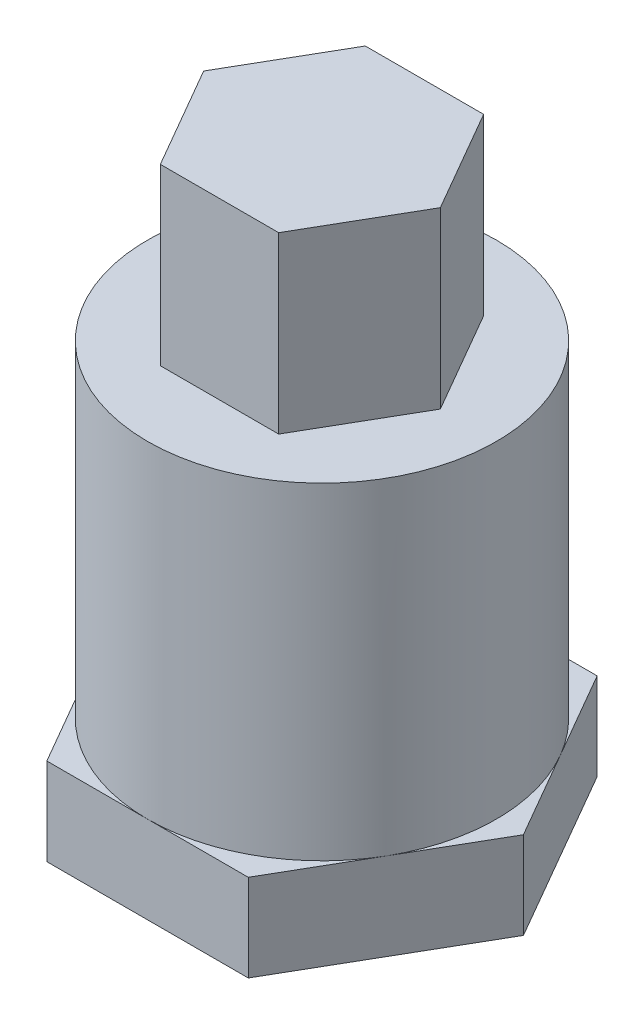
ISO-10303-21;
HEADER;
FILE_DESCRIPTION(('STEP AP214'),'2;1');
FILE_NAME('part.step','',(''),(''),'','','');
FILE_SCHEMA(('AUTOMOTIVE_DESIGN { 1 0 10303 214 1 1 1 1 }'));
ENDSEC;
DATA;
#1=APPLICATION_CONTEXT('core data for automotive mechanical design processes');
#2=APPLICATION_PROTOCOL_DEFINITION('international standard','automotive_design',2000,#1);
#3=PRODUCT_CONTEXT('',#1,'mechanical');
#4=PRODUCT('Part','Part','',(#3));
#5=PRODUCT_RELATED_PRODUCT_CATEGORY('part','',(#4));
#6=PRODUCT_DEFINITION_FORMATION('','',#4);
#7=PRODUCT_DEFINITION_CONTEXT('part definition',#1,'design');
#8=PRODUCT_DEFINITION('design','',#6,#7);
#9=PRODUCT_DEFINITION_SHAPE('','',#8);
#10=(LENGTH_UNIT() NAMED_UNIT(*) SI_UNIT(.MILLI.,.METRE.));
#11=(NAMED_UNIT(*) PLANE_ANGLE_UNIT() SI_UNIT($,.RADIAN.));
#12=(NAMED_UNIT(*) SI_UNIT($,.STERADIAN.) SOLID_ANGLE_UNIT());
#13=UNCERTAINTY_MEASURE_WITH_UNIT(LENGTH_MEASURE(1.E-05),#10,'distance_accuracy_value','');
#14=(GEOMETRIC_REPRESENTATION_CONTEXT(3) GLOBAL_UNCERTAINTY_ASSIGNED_CONTEXT((#13)) GLOBAL_UNIT_ASSIGNED_CONTEXT((#10,
#11,#12)) REPRESENTATION_CONTEXT('',''));
#15=CARTESIAN_POINT('',(0.,0.,0.));
#16=DIRECTION('',(0.,0.,1.));
#17=DIRECTION('',(1.,0.,0.));
#18=AXIS2_PLACEMENT_3D('',#15,#16,#17);
#19=CARTESIAN_POINT('',(2.71354626519129,8.,4.69999999999995));
#20=DIRECTION('',(-0.866025403784441,0.,-0.499999999999995));
#21=DIRECTION('',(-0.499999999999995,0.,0.866025403784442));
#22=AXIS2_PLACEMENT_3D('',#19,#20,#21);
#23=PLANE('',#22);
#24=DIRECTION('',(0.499999999999995,0.,-0.866025403784441));
#25=VECTOR('',#24,1.);
#26=CARTESIAN_POINT('',(2.71354626519129,0.,4.69999999999995));
#27=LINE('',#26,#25);
#28=CARTESIAN_POINT('',(2.71354626519129,0.,4.69999999999995));
#29=VERTEX_POINT('',#28);
#30=CARTESIAN_POINT('',(5.42709253038246,0.,0.));
#31=VERTEX_POINT('',#30);
#32=EDGE_CURVE('E86',#29,#31,#27,.T.);
#33=ORIENTED_EDGE('',*,*,#32,.T.);
#34=DIRECTION('',(0.,-1.,0.));
#35=VECTOR('',#34,1.);
#36=CARTESIAN_POINT('',(5.42709253038246,8.,0.));
#37=LINE('',#36,#35);
#38=CARTESIAN_POINT('',(5.42709253038246,8.,0.));
#39=VERTEX_POINT('',#38);
#40=EDGE_CURVE('E11',#39,#31,#37,.T.);
#41=ORIENTED_EDGE('',*,*,#40,.F.);
#42=DIRECTION('',(0.499999999999995,0.,-0.866025403784441));
#43=VECTOR('',#42,1.);
#44=CARTESIAN_POINT('',(2.71354626519129,8.,4.69999999999995));
#45=LINE('',#44,#43);
#46=CARTESIAN_POINT('',(2.71354626519129,8.,4.69999999999995));
#47=VERTEX_POINT('',#46);
#48=EDGE_CURVE('E147',#47,#39,#45,.T.);
#49=ORIENTED_EDGE('',*,*,#48,.F.);
#50=DIRECTION('',(0.,-1.,0.));
#51=VECTOR('',#50,1.);
#52=CARTESIAN_POINT('',(2.71354626519129,8.,4.69999999999995));
#53=LINE('',#52,#51);
#54=EDGE_CURVE('E127',#47,#29,#53,.T.);
#55=ORIENTED_EDGE('',*,*,#54,.T.);
#56=EDGE_LOOP('',(#33,#41,#49,#55));
#57=FACE_BOUND('',#56,.T.);
#58=ADVANCED_FACE('F39',(#57),#23,.F.);
#59=CARTESIAN_POINT('',(5.42709253038246,8.,0.));
#60=DIRECTION('',(-0.866025403784438,0.,0.500000000000001));
#61=DIRECTION('',(0.500000000000001,0.,0.866025403784438));
#62=AXIS2_PLACEMENT_3D('',#59,#60,#61);
#63=PLANE('',#62);
#64=DIRECTION('',(-0.500000000000001,0.,-0.866025403784438));
#65=VECTOR('',#64,1.);
#66=CARTESIAN_POINT('',(5.42709253038246,0.,0.));
#67=LINE('',#66,#65);
#68=CARTESIAN_POINT('',(2.71354626519122,0.,-4.69999999999999));
#69=VERTEX_POINT('',#68);
#70=EDGE_CURVE('E133',#31,#69,#67,.T.);
#71=ORIENTED_EDGE('',*,*,#70,.T.);
#72=DIRECTION('',(0.,-1.,0.));
#73=VECTOR('',#72,1.);
#74=CARTESIAN_POINT('',(2.71354626519122,8.,-4.69999999999999));
#75=LINE('',#74,#73);
#76=CARTESIAN_POINT('',(2.71354626519122,8.,-4.69999999999999));
#77=VERTEX_POINT('',#76);
#78=EDGE_CURVE('E47',#77,#69,#75,.T.);
#79=ORIENTED_EDGE('',*,*,#78,.F.);
#80=DIRECTION('',(-0.500000000000001,0.,-0.866025403784438));
#81=VECTOR('',#80,1.);
#82=CARTESIAN_POINT('',(5.42709253038246,8.,0.));
#83=LINE('',#82,#81);
#84=EDGE_CURVE('E162',#39,#77,#83,.T.);
#85=ORIENTED_EDGE('',*,*,#84,.F.);
#86=ORIENTED_EDGE('',*,*,#40,.T.);
#87=EDGE_LOOP('',(#71,#79,#85,#86));
#88=FACE_BOUND('',#87,.T.);
#89=ADVANCED_FACE('F161',(#88),#63,.F.);
#90=CARTESIAN_POINT('',(2.71354626519122,8.,-4.69999999999999));
#91=DIRECTION('',(0.,0.,1.));
#92=DIRECTION('',(1.,0.,0.));
#93=AXIS2_PLACEMENT_3D('',#90,#91,#92);
#94=PLANE('',#93);
#95=DIRECTION('',(-1.,0.,0.));
#96=VECTOR('',#95,1.);
#97=CARTESIAN_POINT('',(2.71354626519122,0.,-4.69999999999999));
#98=LINE('',#97,#96);
#99=CARTESIAN_POINT('',(-2.71354626519125,0.,-4.69999999999997));
#100=VERTEX_POINT('',#99);
#101=EDGE_CURVE('E76',#69,#100,#98,.T.);
#102=ORIENTED_EDGE('',*,*,#101,.T.);
#103=DIRECTION('',(0.,-1.,0.));
#104=VECTOR('',#103,1.);
#105=CARTESIAN_POINT('',(-2.71354626519125,8.,-4.69999999999997));
#106=LINE('',#105,#104);
#107=CARTESIAN_POINT('',(-2.71354626519125,8.,-4.69999999999997));
#108=VERTEX_POINT('',#107);
#109=EDGE_CURVE('E119',#108,#100,#106,.T.);
#110=ORIENTED_EDGE('',*,*,#109,.F.);
#111=DIRECTION('',(-1.,0.,0.));
#112=VECTOR('',#111,1.);
#113=CARTESIAN_POINT('',(2.71354626519122,8.,-4.69999999999999));
#114=LINE('',#113,#112);
#115=EDGE_CURVE('E105',#77,#108,#114,.T.);
#116=ORIENTED_EDGE('',*,*,#115,.F.);
#117=ORIENTED_EDGE('',*,*,#78,.T.);
#118=EDGE_LOOP('',(#102,#110,#116,#117));
#119=FACE_BOUND('',#118,.T.);
#120=ADVANCED_FACE('F158',(#119),#94,.F.);
#121=CARTESIAN_POINT('',(-2.71354626519125,8.,-4.69999999999997));
#122=DIRECTION('',(0.866025403784442,0.,0.499999999999995));
#123=DIRECTION('',(0.499999999999995,0.,-0.866025403784442));
#124=AXIS2_PLACEMENT_3D('',#121,#122,#123);
#125=PLANE('',#124);
#126=DIRECTION('',(-0.499999999999995,0.,0.866025403784442));
#127=VECTOR('',#126,1.);
#128=CARTESIAN_POINT('',(-2.71354626519125,0.,-4.69999999999997));
#129=LINE('',#128,#127);
#130=CARTESIAN_POINT('',(-5.42709253038246,0.,0.));
#131=VERTEX_POINT('',#130);
#132=EDGE_CURVE('E115',#100,#131,#129,.T.);
#133=ORIENTED_EDGE('',*,*,#132,.T.);
#134=DIRECTION('',(0.,-1.,0.));
#135=VECTOR('',#134,1.);
#136=CARTESIAN_POINT('',(-5.42709253038246,8.,0.));
#137=LINE('',#136,#135);
#138=CARTESIAN_POINT('',(-5.42709253038246,8.,0.));
#139=VERTEX_POINT('',#138);
#140=EDGE_CURVE('E113',#139,#131,#137,.T.);
#141=ORIENTED_EDGE('',*,*,#140,.F.);
#142=DIRECTION('',(-0.499999999999995,0.,0.866025403784442));
#143=VECTOR('',#142,1.);
#144=CARTESIAN_POINT('',(-2.71354626519125,8.,-4.69999999999997));
#145=LINE('',#144,#143);
#146=EDGE_CURVE('E98',#108,#139,#145,.T.);
#147=ORIENTED_EDGE('',*,*,#146,.F.);
#148=ORIENTED_EDGE('',*,*,#109,.T.);
#149=EDGE_LOOP('',(#133,#141,#147,#148));
#150=FACE_BOUND('',#149,.T.);
#151=ADVANCED_FACE('F114',(#150),#125,.F.);
#152=CARTESIAN_POINT('',(-5.42709253038246,8.,0.));
#153=DIRECTION('',(0.866025403784435,0.,-0.500000000000007));
#154=DIRECTION('',(-0.500000000000007,0.,-0.866025403784434));
#155=AXIS2_PLACEMENT_3D('',#152,#153,#154);
#156=PLANE('',#155);
#157=DIRECTION('',(0.500000000000007,0.,0.866025403784434));
#158=VECTOR('',#157,1.);
#159=CARTESIAN_POINT('',(-5.42709253038246,0.,0.));
#160=LINE('',#159,#158);
#161=CARTESIAN_POINT('',(-2.71354626519119,0.,4.70000000000001));
#162=VERTEX_POINT('',#161);
#163=EDGE_CURVE('E141',#131,#162,#160,.T.);
#164=ORIENTED_EDGE('',*,*,#163,.T.);
#165=DIRECTION('',(0.,-1.,0.));
#166=VECTOR('',#165,1.);
#167=CARTESIAN_POINT('',(-2.71354626519119,8.,4.70000000000001));
#168=LINE('',#167,#166);
#169=CARTESIAN_POINT('',(-2.71354626519119,8.,4.70000000000001));
#170=VERTEX_POINT('',#169);
#171=EDGE_CURVE('E120',#170,#162,#168,.T.);
#172=ORIENTED_EDGE('',*,*,#171,.F.);
#173=DIRECTION('',(0.500000000000007,0.,0.866025403784434));
#174=VECTOR('',#173,1.);
#175=CARTESIAN_POINT('',(-5.42709253038246,8.,0.));
#176=LINE('',#175,#174);
#177=EDGE_CURVE('E102',#139,#170,#176,.T.);
#178=ORIENTED_EDGE('',*,*,#177,.F.);
#179=ORIENTED_EDGE('',*,*,#140,.T.);
#180=EDGE_LOOP('',(#164,#172,#178,#179));
#181=FACE_BOUND('',#180,.T.);
#182=ADVANCED_FACE('F122',(#181),#156,.F.);
#183=CARTESIAN_POINT('',(-2.71354626519119,8.,4.70000000000001));
#184=DIRECTION('',(0.,0.,-1.));
#185=DIRECTION('',(-1.,0.,0.));
#186=AXIS2_PLACEMENT_3D('',#183,#184,#185);
#187=PLANE('',#186);
#188=DIRECTION('',(1.,0.,0.));
#189=VECTOR('',#188,1.);
#190=CARTESIAN_POINT('',(-2.71354626519119,0.,4.70000000000001));
#191=LINE('',#190,#189);
#192=EDGE_CURVE('E144',#162,#29,#191,.T.);
#193=ORIENTED_EDGE('',*,*,#192,.T.);
#194=ORIENTED_EDGE('',*,*,#54,.F.);
#195=DIRECTION('',(1.,0.,0.));
#196=VECTOR('',#195,1.);
#197=CARTESIAN_POINT('',(-2.71354626519119,8.,4.70000000000001));
#198=LINE('',#197,#196);
#199=EDGE_CURVE('E63',#170,#47,#198,.T.);
#200=ORIENTED_EDGE('',*,*,#199,.F.);
#201=ORIENTED_EDGE('',*,*,#171,.T.);
#202=EDGE_LOOP('',(#193,#194,#200,#201));
#203=FACE_BOUND('',#202,.T.);
#204=ADVANCED_FACE('F176',(#203),#187,.F.);
#205=CARTESIAN_POINT('',(0.,8.,0.));
#206=DIRECTION('',(0.,1.,0.));
#207=DIRECTION('',(0.,0.,1.));
#208=AXIS2_PLACEMENT_3D('',#205,#206,#207);
#209=PLANE('',#208);
#210=ORIENTED_EDGE('',*,*,#48,.T.);
#211=ORIENTED_EDGE('',*,*,#84,.T.);
#212=ORIENTED_EDGE('',*,*,#115,.T.);
#213=ORIENTED_EDGE('',*,*,#146,.T.);
#214=ORIENTED_EDGE('',*,*,#177,.T.);
#215=ORIENTED_EDGE('',*,*,#199,.T.);
#216=EDGE_LOOP('',(#210,#211,#212,#213,#214,#215));
#217=FACE_BOUND('',#216,.T.);
#218=ADVANCED_FACE('F100',(#217),#209,.T.);
#219=CARTESIAN_POINT('',(0.,-15.,0.));
#220=DIRECTION('',(0.,1.,0.));
#221=DIRECTION('',(0.,0.,1.));
#222=AXIS2_PLACEMENT_3D('',#219,#220,#221);
#223=CYLINDRICAL_SURFACE('',#222,8.);
#224=CARTESIAN_POINT('',(0.,-15.,0.));
#225=DIRECTION('',(0.,1.,0.));
#226=DIRECTION('',(0.,0.,1.));
#227=AXIS2_PLACEMENT_3D('',#224,#225,#226);
#228=CIRCLE('',#227,8.);
#229=CARTESIAN_POINT('',(0.,-15.,8.));
#230=VERTEX_POINT('',#229);
#231=CARTESIAN_POINT('',(6.92820323027551,-15.,4.));
#232=VERTEX_POINT('',#231);
#233=EDGE_CURVE('E188',#230,#232,#228,.T.);
#234=ORIENTED_EDGE('',*,*,#233,.T.);
#235=CARTESIAN_POINT('',(6.92820323027551,-15.,-4.));
#236=VERTEX_POINT('',#235);
#237=EDGE_CURVE('E192',#232,#236,#228,.T.);
#238=ORIENTED_EDGE('',*,*,#237,.T.);
#239=CARTESIAN_POINT('',(0.,-15.,-8.));
#240=VERTEX_POINT('',#239);
#241=EDGE_CURVE('E326',#236,#240,#228,.T.);
#242=ORIENTED_EDGE('',*,*,#241,.T.);
#243=CARTESIAN_POINT('',(-6.92820323027551,-15.,-4.));
#244=VERTEX_POINT('',#243);
#245=EDGE_CURVE('E319',#240,#244,#228,.T.);
#246=ORIENTED_EDGE('',*,*,#245,.T.);
#247=CARTESIAN_POINT('',(-6.92820323027551,-15.,4.));
#248=VERTEX_POINT('',#247);
#249=EDGE_CURVE('E327',#244,#248,#228,.T.);
#250=ORIENTED_EDGE('',*,*,#249,.T.);
#251=EDGE_CURVE('E193',#248,#230,#228,.T.);
#252=ORIENTED_EDGE('',*,*,#251,.T.);
#253=EDGE_LOOP('',(#234,#238,#242,#246,#250,#252));
#254=FACE_BOUND('',#253,.T.);
#255=CARTESIAN_POINT('',(0.,0.,0.));
#256=DIRECTION('',(0.,-1.,0.));
#257=DIRECTION('',(0.,0.,-1.));
#258=AXIS2_PLACEMENT_3D('',#255,#256,#257);
#259=CIRCLE('',#258,8.);
#260=CARTESIAN_POINT('',(0.,0.,-8.));
#261=VERTEX_POINT('',#260);
#262=EDGE_CURVE('E134',#261,#261,#259,.T.);
#263=ORIENTED_EDGE('',*,*,#262,.T.);
#264=EDGE_LOOP('',(#263));
#265=FACE_BOUND('',#264,.T.);
#266=ADVANCED_FACE('F338',(#254,#265),#223,.T.);
#267=CARTESIAN_POINT('',(0.,0.,0.));
#268=DIRECTION('',(0.,-1.,0.));
#269=DIRECTION('',(0.,0.,-1.));
#270=AXIS2_PLACEMENT_3D('',#267,#268,#269);
#271=PLANE('',#270);
#272=ORIENTED_EDGE('',*,*,#32,.F.);
#273=ORIENTED_EDGE('',*,*,#192,.F.);
#274=ORIENTED_EDGE('',*,*,#163,.F.);
#275=ORIENTED_EDGE('',*,*,#132,.F.);
#276=ORIENTED_EDGE('',*,*,#101,.F.);
#277=ORIENTED_EDGE('',*,*,#70,.F.);
#278=EDGE_LOOP('',(#272,#273,#274,#275,#276,#277));
#279=FACE_BOUND('',#278,.T.);
#280=ORIENTED_EDGE('',*,*,#262,.F.);
#281=EDGE_LOOP('',(#280));
#282=FACE_BOUND('',#281,.T.);
#283=ADVANCED_FACE('F165',(#279,#282),#271,.F.);
#284=CARTESIAN_POINT('',(0.,-15.,0.));
#285=DIRECTION('',(0.,-1.,0.));
#286=DIRECTION('',(0.,0.,-1.));
#287=AXIS2_PLACEMENT_3D('',#284,#285,#286);
#288=PLANE('',#287);
#289=ORIENTED_EDGE('',*,*,#233,.F.);
#290=DIRECTION('',(-1.,0.,0.));
#291=VECTOR('',#290,1.);
#292=CARTESIAN_POINT('',(4.61880215351701,-15.,8.));
#293=LINE('',#292,#291);
#294=CARTESIAN_POINT('',(4.61880215351701,-15.,8.));
#295=VERTEX_POINT('',#294);
#296=EDGE_CURVE('E54',#295,#230,#293,.T.);
#297=ORIENTED_EDGE('',*,*,#296,.F.);
#298=DIRECTION('',(-0.5,0.,0.866025403784439));
#299=VECTOR('',#298,1.);
#300=CARTESIAN_POINT('',(9.23760430703402,-15.,0.));
#301=LINE('',#300,#299);
#302=EDGE_CURVE('E226',#232,#295,#301,.T.);
#303=ORIENTED_EDGE('',*,*,#302,.F.);
#304=EDGE_LOOP('',(#289,#297,#303));
#305=FACE_BOUND('',#304,.T.);
#306=ADVANCED_FACE('F370',(#305),#288,.F.);
#307=ORIENTED_EDGE('',*,*,#237,.F.);
#308=CARTESIAN_POINT('',(9.23760430703402,-15.,0.));
#309=VERTEX_POINT('',#308);
#310=EDGE_CURVE('E222',#309,#232,#301,.T.);
#311=ORIENTED_EDGE('',*,*,#310,.F.);
#312=DIRECTION('',(0.5,0.,0.866025403784439));
#313=VECTOR('',#312,1.);
#314=CARTESIAN_POINT('',(4.61880215351701,-15.,-8.));
#315=LINE('',#314,#313);
#316=EDGE_CURVE('E231',#236,#309,#315,.T.);
#317=ORIENTED_EDGE('',*,*,#316,.F.);
#318=EDGE_LOOP('',(#307,#311,#317));
#319=FACE_BOUND('',#318,.T.);
#320=ADVANCED_FACE('F373',(#319),#288,.F.);
#321=ORIENTED_EDGE('',*,*,#241,.F.);
#322=CARTESIAN_POINT('',(4.61880215351701,-15.,-8.));
#323=VERTEX_POINT('',#322);
#324=EDGE_CURVE('E227',#323,#236,#315,.T.);
#325=ORIENTED_EDGE('',*,*,#324,.F.);
#326=DIRECTION('',(1.,0.,0.));
#327=VECTOR('',#326,1.);
#328=CARTESIAN_POINT('',(-4.61880215351701,-15.,-8.));
#329=LINE('',#328,#327);
#330=EDGE_CURVE('E236',#240,#323,#329,.T.);
#331=ORIENTED_EDGE('',*,*,#330,.F.);
#332=EDGE_LOOP('',(#321,#325,#331));
#333=FACE_BOUND('',#332,.T.);
#334=ADVANCED_FACE('F330',(#333),#288,.F.);
#335=ORIENTED_EDGE('',*,*,#245,.F.);
#336=CARTESIAN_POINT('',(-4.61880215351701,-15.,-8.));
#337=VERTEX_POINT('',#336);
#338=EDGE_CURVE('E232',#337,#240,#329,.T.);
#339=ORIENTED_EDGE('',*,*,#338,.F.);
#340=DIRECTION('',(0.5,0.,-0.866025403784439));
#341=VECTOR('',#340,1.);
#342=CARTESIAN_POINT('',(-9.23760430703402,-15.,0.));
#343=LINE('',#342,#341);
#344=EDGE_CURVE('E241',#244,#337,#343,.T.);
#345=ORIENTED_EDGE('',*,*,#344,.F.);
#346=EDGE_LOOP('',(#335,#339,#345));
#347=FACE_BOUND('',#346,.T.);
#348=ADVANCED_FACE('F321',(#347),#288,.F.);
#349=ORIENTED_EDGE('',*,*,#249,.F.);
#350=CARTESIAN_POINT('',(-9.23760430703402,-15.,0.));
#351=VERTEX_POINT('',#350);
#352=EDGE_CURVE('E237',#351,#244,#343,.T.);
#353=ORIENTED_EDGE('',*,*,#352,.F.);
#354=DIRECTION('',(-0.5,0.,-0.866025403784439));
#355=VECTOR('',#354,1.);
#356=CARTESIAN_POINT('',(-4.61880215351701,-15.,8.));
#357=LINE('',#356,#355);
#358=EDGE_CURVE('E246',#248,#351,#357,.T.);
#359=ORIENTED_EDGE('',*,*,#358,.F.);
#360=EDGE_LOOP('',(#349,#353,#359));
#361=FACE_BOUND('',#360,.T.);
#362=ADVANCED_FACE('F350',(#361),#288,.F.);
#363=CARTESIAN_POINT('',(-4.61880215351701,-19.,8.));
#364=DIRECTION('',(0.866025403784439,0.,-0.5));
#365=DIRECTION('',(-0.5,0.,-0.866025403784439));
#366=AXIS2_PLACEMENT_3D('',#363,#364,#365);
#367=PLANE('',#366);
#368=CARTESIAN_POINT('',(-4.61880215351701,-15.,8.));
#369=VERTEX_POINT('',#368);
#370=EDGE_CURVE('E242',#369,#248,#357,.T.);
#371=ORIENTED_EDGE('',*,*,#370,.T.);
#372=ORIENTED_EDGE('',*,*,#358,.T.);
#373=DIRECTION('',(0.,1.,0.));
#374=VECTOR('',#373,1.);
#375=CARTESIAN_POINT('',(-9.23760430703402,-19.,0.));
#376=LINE('',#375,#374);
#377=CARTESIAN_POINT('',(-9.23760430703402,-19.,0.));
#378=VERTEX_POINT('',#377);
#379=EDGE_CURVE('E194',#378,#351,#376,.T.);
#380=ORIENTED_EDGE('',*,*,#379,.F.);
#381=DIRECTION('',(-0.5,0.,-0.866025403784439));
#382=VECTOR('',#381,1.);
#383=CARTESIAN_POINT('',(-4.61880215351701,-19.,8.));
#384=LINE('',#383,#382);
#385=CARTESIAN_POINT('',(-4.61880215351701,-19.,8.));
#386=VERTEX_POINT('',#385);
#387=EDGE_CURVE('E220',#386,#378,#384,.T.);
#388=ORIENTED_EDGE('',*,*,#387,.F.);
#389=DIRECTION('',(0.,1.,0.));
#390=VECTOR('',#389,1.);
#391=CARTESIAN_POINT('',(-4.61880215351701,-19.,8.));
#392=LINE('',#391,#390);
#393=EDGE_CURVE('E213',#386,#369,#392,.T.);
#394=ORIENTED_EDGE('',*,*,#393,.T.);
#395=EDGE_LOOP('',(#371,#372,#380,#388,#394));
#396=FACE_BOUND('',#395,.T.);
#397=ADVANCED_FACE('F283',(#396),#367,.F.);
#398=CARTESIAN_POINT('',(-9.23760430703402,-19.,0.));
#399=DIRECTION('',(0.866025403784439,0.,0.5));
#400=DIRECTION('',(0.5,0.,-0.866025403784439));
#401=AXIS2_PLACEMENT_3D('',#398,#399,#400);
#402=PLANE('',#401);
#403=ORIENTED_EDGE('',*,*,#352,.T.);
#404=ORIENTED_EDGE('',*,*,#344,.T.);
#405=DIRECTION('',(0.,1.,0.));
#406=VECTOR('',#405,1.);
#407=CARTESIAN_POINT('',(-4.61880215351701,-19.,-8.));
#408=LINE('',#407,#406);
#409=CARTESIAN_POINT('',(-4.61880215351701,-19.,-8.));
#410=VERTEX_POINT('',#409);
#411=EDGE_CURVE('E198',#410,#337,#408,.T.);
#412=ORIENTED_EDGE('',*,*,#411,.F.);
#413=DIRECTION('',(0.5,0.,-0.866025403784439));
#414=VECTOR('',#413,1.);
#415=CARTESIAN_POINT('',(-9.23760430703402,-19.,0.));
#416=LINE('',#415,#414);
#417=EDGE_CURVE('E262',#378,#410,#416,.T.);
#418=ORIENTED_EDGE('',*,*,#417,.F.);
#419=ORIENTED_EDGE('',*,*,#379,.T.);
#420=EDGE_LOOP('',(#403,#404,#412,#418,#419));
#421=FACE_BOUND('',#420,.T.);
#422=ADVANCED_FACE('F288',(#421),#402,.F.);
#423=CARTESIAN_POINT('',(-4.61880215351701,-19.,-8.));
#424=DIRECTION('',(0.,0.,1.));
#425=DIRECTION('',(1.,0.,0.));
#426=AXIS2_PLACEMENT_3D('',#423,#424,#425);
#427=PLANE('',#426);
#428=ORIENTED_EDGE('',*,*,#338,.T.);
#429=ORIENTED_EDGE('',*,*,#330,.T.);
#430=DIRECTION('',(0.,1.,0.));
#431=VECTOR('',#430,1.);
#432=CARTESIAN_POINT('',(4.61880215351701,-19.,-8.));
#433=LINE('',#432,#431);
#434=CARTESIAN_POINT('',(4.61880215351701,-19.,-8.));
#435=VERTEX_POINT('',#434);
#436=EDGE_CURVE('E202',#435,#323,#433,.T.);
#437=ORIENTED_EDGE('',*,*,#436,.F.);
#438=DIRECTION('',(1.,0.,0.));
#439=VECTOR('',#438,1.);
#440=CARTESIAN_POINT('',(-4.61880215351701,-19.,-8.));
#441=LINE('',#440,#439);
#442=EDGE_CURVE('E258',#410,#435,#441,.T.);
#443=ORIENTED_EDGE('',*,*,#442,.F.);
#444=ORIENTED_EDGE('',*,*,#411,.T.);
#445=EDGE_LOOP('',(#428,#429,#437,#443,#444));
#446=FACE_BOUND('',#445,.T.);
#447=ADVANCED_FACE('F335',(#446),#427,.F.);
#448=CARTESIAN_POINT('',(4.61880215351701,-19.,-8.));
#449=DIRECTION('',(-0.866025403784439,0.,0.5));
#450=DIRECTION('',(0.5,0.,0.866025403784439));
#451=AXIS2_PLACEMENT_3D('',#448,#449,#450);
#452=PLANE('',#451);
#453=ORIENTED_EDGE('',*,*,#324,.T.);
#454=ORIENTED_EDGE('',*,*,#316,.T.);
#455=DIRECTION('',(0.,1.,0.));
#456=VECTOR('',#455,1.);
#457=CARTESIAN_POINT('',(9.23760430703402,-19.,0.));
#458=LINE('',#457,#456);
#459=CARTESIAN_POINT('',(9.23760430703402,-19.,0.));
#460=VERTEX_POINT('',#459);
#461=EDGE_CURVE('E206',#460,#309,#458,.T.);
#462=ORIENTED_EDGE('',*,*,#461,.F.);
#463=DIRECTION('',(0.5,0.,0.866025403784439));
#464=VECTOR('',#463,1.);
#465=CARTESIAN_POINT('',(4.61880215351701,-19.,-8.));
#466=LINE('',#465,#464);
#467=EDGE_CURVE('E254',#435,#460,#466,.T.);
#468=ORIENTED_EDGE('',*,*,#467,.F.);
#469=ORIENTED_EDGE('',*,*,#436,.T.);
#470=EDGE_LOOP('',(#453,#454,#462,#468,#469));
#471=FACE_BOUND('',#470,.T.);
#472=ADVANCED_FACE('F364',(#471),#452,.F.);
#473=CARTESIAN_POINT('',(9.23760430703402,-19.,0.));
#474=DIRECTION('',(-0.866025403784439,0.,-0.5));
#475=DIRECTION('',(-0.5,0.,0.866025403784439));
#476=AXIS2_PLACEMENT_3D('',#473,#474,#475);
#477=PLANE('',#476);
#478=ORIENTED_EDGE('',*,*,#310,.T.);
#479=ORIENTED_EDGE('',*,*,#302,.T.);
#480=DIRECTION('',(0.,1.,0.));
#481=VECTOR('',#480,1.);
#482=CARTESIAN_POINT('',(4.61880215351701,-19.,8.));
#483=LINE('',#482,#481);
#484=CARTESIAN_POINT('',(4.61880215351701,-19.,8.));
#485=VERTEX_POINT('',#484);
#486=EDGE_CURVE('E210',#485,#295,#483,.T.);
#487=ORIENTED_EDGE('',*,*,#486,.F.);
#488=DIRECTION('',(-0.5,0.,0.866025403784439));
#489=VECTOR('',#488,1.);
#490=CARTESIAN_POINT('',(9.23760430703402,-19.,0.));
#491=LINE('',#490,#489);
#492=EDGE_CURVE('E250',#460,#485,#491,.T.);
#493=ORIENTED_EDGE('',*,*,#492,.F.);
#494=ORIENTED_EDGE('',*,*,#461,.T.);
#495=EDGE_LOOP('',(#478,#479,#487,#493,#494));
#496=FACE_BOUND('',#495,.T.);
#497=ADVANCED_FACE('F367',(#496),#477,.F.);
#498=CARTESIAN_POINT('',(4.61880215351701,-19.,8.));
#499=DIRECTION('',(0.,0.,-1.));
#500=DIRECTION('',(-1.,0.,0.));
#501=AXIS2_PLACEMENT_3D('',#498,#499,#500);
#502=PLANE('',#501);
#503=ORIENTED_EDGE('',*,*,#296,.T.);
#504=EDGE_CURVE('E221',#230,#369,#293,.T.);
#505=ORIENTED_EDGE('',*,*,#504,.T.);
#506=ORIENTED_EDGE('',*,*,#393,.F.);
#507=DIRECTION('',(-1.,0.,0.));
#508=VECTOR('',#507,1.);
#509=CARTESIAN_POINT('',(4.61880215351701,-19.,8.));
#510=LINE('',#509,#508);
#511=EDGE_CURVE('E217',#485,#386,#510,.T.);
#512=ORIENTED_EDGE('',*,*,#511,.F.);
#513=ORIENTED_EDGE('',*,*,#486,.T.);
#514=EDGE_LOOP('',(#503,#505,#506,#512,#513));
#515=FACE_BOUND('',#514,.T.);
#516=ADVANCED_FACE('F352',(#515),#502,.F.);
#517=CARTESIAN_POINT('',(0.,-19.,0.));
#518=DIRECTION('',(0.,-1.,0.));
#519=DIRECTION('',(0.,0.,-1.));
#520=AXIS2_PLACEMENT_3D('',#517,#518,#519);
#521=PLANE('',#520);
#522=ORIENTED_EDGE('',*,*,#387,.T.);
#523=ORIENTED_EDGE('',*,*,#417,.T.);
#524=ORIENTED_EDGE('',*,*,#442,.T.);
#525=ORIENTED_EDGE('',*,*,#467,.T.);
#526=ORIENTED_EDGE('',*,*,#492,.T.);
#527=ORIENTED_EDGE('',*,*,#511,.T.);
#528=EDGE_LOOP('',(#522,#523,#524,#525,#526,#527));
#529=FACE_BOUND('',#528,.T.);
#530=ADVANCED_FACE('F272',(#529),#521,.T.);
#531=ORIENTED_EDGE('',*,*,#251,.F.);
#532=ORIENTED_EDGE('',*,*,#370,.F.);
#533=ORIENTED_EDGE('',*,*,#504,.F.);
#534=EDGE_LOOP('',(#531,#532,#533));
#535=FACE_BOUND('',#534,.T.);
#536=ADVANCED_FACE('F348',(#535),#288,.F.);
#537=CLOSED_SHELL('',(#58,#89,#120,#151,#182,#204,#218,#266,#283,#306,#320,#334,#348,#362,#397,
#422,#447,#472,#497,#516,#530,#536));
#538=MANIFOLD_SOLID_BREP('B2',#537);
#539=ADVANCED_BREP_SHAPE_REPRESENTATION('',(#18,#538),#14);
#540=SHAPE_DEFINITION_REPRESENTATION(#9,#539);
ENDSEC;
END-ISO-10303-21;
